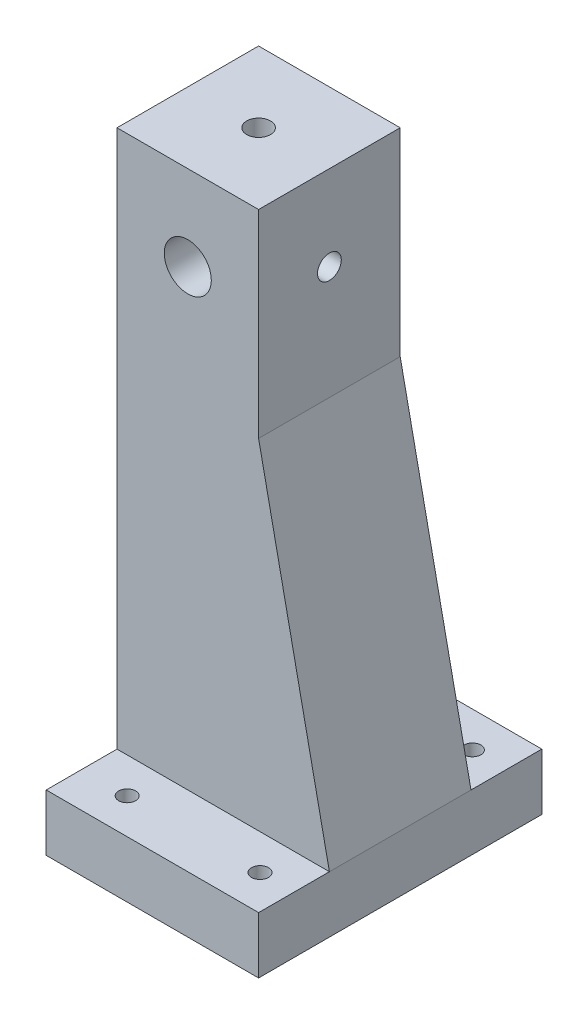
ISO-10303-21;
HEADER;
FILE_DESCRIPTION(('STEP AP214'),'2;1');
FILE_NAME('part.step','',(''),(''),'','','');
FILE_SCHEMA(('AUTOMOTIVE_DESIGN { 1 0 10303 214 1 1 1 1 }'));
ENDSEC;
DATA;
#1=APPLICATION_CONTEXT('core data for automotive mechanical design processes');
#2=APPLICATION_PROTOCOL_DEFINITION('international standard','automotive_design',2000,#1);
#3=PRODUCT_CONTEXT('',#1,'mechanical');
#4=PRODUCT('Part','Part','',(#3));
#5=PRODUCT_RELATED_PRODUCT_CATEGORY('part','',(#4));
#6=PRODUCT_DEFINITION_FORMATION('','',#4);
#7=PRODUCT_DEFINITION_CONTEXT('part definition',#1,'design');
#8=PRODUCT_DEFINITION('design','',#6,#7);
#9=PRODUCT_DEFINITION_SHAPE('','',#8);
#10=(LENGTH_UNIT() NAMED_UNIT(*) SI_UNIT(.MILLI.,.METRE.));
#11=(NAMED_UNIT(*) PLANE_ANGLE_UNIT() SI_UNIT($,.RADIAN.));
#12=(NAMED_UNIT(*) SI_UNIT($,.STERADIAN.) SOLID_ANGLE_UNIT());
#13=UNCERTAINTY_MEASURE_WITH_UNIT(LENGTH_MEASURE(1.E-05),#10,'distance_accuracy_value','');
#14=(GEOMETRIC_REPRESENTATION_CONTEXT(3) GLOBAL_UNCERTAINTY_ASSIGNED_CONTEXT((#13)) GLOBAL_UNIT_ASSIGNED_CONTEXT((#10,
#11,#12)) REPRESENTATION_CONTEXT('',''));
#15=CARTESIAN_POINT('',(0.,0.,0.));
#16=DIRECTION('',(0.,0.,1.));
#17=DIRECTION('',(1.,0.,0.));
#18=AXIS2_PLACEMENT_3D('',#15,#16,#17);
#19=CARTESIAN_POINT('',(0.,9.99999999999999,0.));
#20=DIRECTION('',(0.,1.,0.));
#21=DIRECTION('',(0.,0.,1.));
#22=AXIS2_PLACEMENT_3D('',#19,#20,#21);
#23=PLANE('',#22);
#24=CARTESIAN_POINT('',(-4.45648688352142,10.,-18.75));
#25=DIRECTION('',(0.,1.,0.));
#26=DIRECTION('',(0.,0.,1.));
#27=AXIS2_PLACEMENT_3D('',#24,#25,#26);
#28=CIRCLE('',#27,1.5);
#29=CARTESIAN_POINT('',(-4.45648688352142,10.,-17.25));
#30=VERTEX_POINT('',#29);
#31=EDGE_CURVE('E277',#30,#30,#28,.T.);
#32=ORIENTED_EDGE('',*,*,#31,.F.);
#33=EDGE_LOOP('',(#32));
#34=FACE_BOUND('',#33,.T.);
#35=CARTESIAN_POINT('',(19.,9.99999999999999,-18.75));
#36=DIRECTION('',(0.,1.,0.));
#37=DIRECTION('',(0.,0.,1.));
#38=AXIS2_PLACEMENT_3D('',#35,#36,#37);
#39=CIRCLE('',#38,1.5);
#40=CARTESIAN_POINT('',(19.,9.99999999999999,-17.25));
#41=VERTEX_POINT('',#40);
#42=EDGE_CURVE('E139',#41,#41,#39,.T.);
#43=ORIENTED_EDGE('',*,*,#42,.F.);
#44=EDGE_LOOP('',(#43));
#45=FACE_BOUND('',#44,.T.);
#46=DIRECTION('',(1.,0.,0.));
#47=VECTOR('',#46,1.);
#48=CARTESIAN_POINT('',(0.,10.,-12.5));
#49=LINE('',#48,#47);
#50=CARTESIAN_POINT('',(-12.5,10.,-12.5));
#51=VERTEX_POINT('',#50);
#52=CARTESIAN_POINT('',(25.,9.99999999999999,-12.5));
#53=VERTEX_POINT('',#52);
#54=EDGE_CURVE('E48',#51,#53,#49,.T.);
#55=ORIENTED_EDGE('',*,*,#54,.T.);
#56=DIRECTION('',(0.,0.,-1.));
#57=VECTOR('',#56,1.);
#58=CARTESIAN_POINT('',(25.,9.99999999999997,0.));
#59=LINE('',#58,#57);
#60=CARTESIAN_POINT('',(25.,9.99999999999999,-25.0000000000001));
#61=VERTEX_POINT('',#60);
#62=EDGE_CURVE('E138',#53,#61,#59,.T.);
#63=ORIENTED_EDGE('',*,*,#62,.T.);
#64=DIRECTION('',(-1.,0.,0.));
#65=VECTOR('',#64,1.);
#66=CARTESIAN_POINT('',(0.,10.,-25.));
#67=LINE('',#66,#65);
#68=CARTESIAN_POINT('',(-12.5,10.,-25.));
#69=VERTEX_POINT('',#68);
#70=EDGE_CURVE('E291',#61,#69,#67,.T.);
#71=ORIENTED_EDGE('',*,*,#70,.T.);
#72=DIRECTION('',(0.,0.,-1.));
#73=VECTOR('',#72,1.);
#74=CARTESIAN_POINT('',(-12.5,10.,-25.));
#75=LINE('',#74,#73);
#76=EDGE_CURVE('E263',#51,#69,#75,.T.);
#77=ORIENTED_EDGE('',*,*,#76,.F.);
#78=EDGE_LOOP('',(#55,#63,#71,#77));
#79=FACE_BOUND('',#78,.T.);
#80=ADVANCED_FACE('F34',(#34,#45,#79),#23,.T.);
#81=CARTESIAN_POINT('',(12.5,105.,0.));
#82=DIRECTION('',(1.,0.,0.));
#83=DIRECTION('',(0.,0.,-1.));
#84=AXIS2_PLACEMENT_3D('',#81,#82,#83);
#85=PLANE('',#84);
#86=CARTESIAN_POINT('',(12.5,90.,0.));
#87=DIRECTION('',(1.,0.,0.));
#88=DIRECTION('',(0.,0.,-1.));
#89=AXIS2_PLACEMENT_3D('',#86,#87,#88);
#90=CIRCLE('',#89,2.10000000000001);
#91=CARTESIAN_POINT('',(12.5,90.,-2.10000000000009));
#92=VERTEX_POINT('',#91);
#93=EDGE_CURVE('E164',#92,#92,#90,.T.);
#94=ORIENTED_EDGE('',*,*,#93,.F.);
#95=EDGE_LOOP('',(#94));
#96=FACE_BOUND('',#95,.T.);
#97=DIRECTION('',(0.,-1.,0.));
#98=VECTOR('',#97,1.);
#99=CARTESIAN_POINT('',(12.5,105.,12.4999999999999));
#100=LINE('',#99,#98);
#101=CARTESIAN_POINT('',(12.5,105.,12.4999999999999));
#102=VERTEX_POINT('',#101);
#103=CARTESIAN_POINT('',(12.5,70.,12.4999999999999));
#104=VERTEX_POINT('',#103);
#105=EDGE_CURVE('E254',#102,#104,#100,.T.);
#106=ORIENTED_EDGE('',*,*,#105,.T.);
#107=DIRECTION('',(0.,0.,-1.));
#108=VECTOR('',#107,1.);
#109=CARTESIAN_POINT('',(12.5,70.,12.4999999999999));
#110=LINE('',#109,#108);
#111=CARTESIAN_POINT('',(12.5,70.,-12.5000000000001));
#112=VERTEX_POINT('',#111);
#113=EDGE_CURVE('E127',#104,#112,#110,.T.);
#114=ORIENTED_EDGE('',*,*,#113,.T.);
#115=DIRECTION('',(0.,-1.,0.));
#116=VECTOR('',#115,1.);
#117=CARTESIAN_POINT('',(12.5,105.,-12.5000000000001));
#118=LINE('',#117,#116);
#119=CARTESIAN_POINT('',(12.5,105.,-12.5000000000001));
#120=VERTEX_POINT('',#119);
#121=EDGE_CURVE('E151',#120,#112,#118,.T.);
#122=ORIENTED_EDGE('',*,*,#121,.F.);
#123=DIRECTION('',(0.,0.,1.));
#124=VECTOR('',#123,1.);
#125=CARTESIAN_POINT('',(12.5,105.,0.));
#126=LINE('',#125,#124);
#127=EDGE_CURVE('E156',#120,#102,#126,.T.);
#128=ORIENTED_EDGE('',*,*,#127,.T.);
#129=EDGE_LOOP('',(#106,#114,#122,#128));
#130=FACE_BOUND('',#129,.T.);
#131=ADVANCED_FACE('F205',(#96,#130),#85,.T.);
#132=CARTESIAN_POINT('',(0.,10.,12.4999999999999));
#133=DIRECTION('',(0.,0.,-1.));
#134=DIRECTION('',(-1.,0.,0.));
#135=AXIS2_PLACEMENT_3D('',#132,#133,#134);
#136=PLANE('',#135);
#137=CARTESIAN_POINT('',(0.,90.,12.4999999999999));
#138=DIRECTION('',(0.,0.,1.));
#139=DIRECTION('',(1.,0.,0.));
#140=AXIS2_PLACEMENT_3D('',#137,#138,#139);
#141=CIRCLE('',#140,4.15);
#142=CARTESIAN_POINT('',(4.14999999999997,90.,12.4999999999999));
#143=VERTEX_POINT('',#142);
#144=EDGE_CURVE('E157',#143,#143,#141,.T.);
#145=ORIENTED_EDGE('',*,*,#144,.F.);
#146=EDGE_LOOP('',(#145));
#147=FACE_BOUND('',#146,.T.);
#148=DIRECTION('',(0.,-1.,0.));
#149=VECTOR('',#148,1.);
#150=CARTESIAN_POINT('',(-12.5000000000001,105.,12.5));
#151=LINE('',#150,#149);
#152=CARTESIAN_POINT('',(-12.5000000000001,105.,12.5));
#153=VERTEX_POINT('',#152);
#154=CARTESIAN_POINT('',(-12.5,10.,12.4999999999999));
#155=VERTEX_POINT('',#154);
#156=EDGE_CURVE('E116',#153,#155,#151,.T.);
#157=ORIENTED_EDGE('',*,*,#156,.T.);
#158=DIRECTION('',(1.,0.,0.));
#159=VECTOR('',#158,1.);
#160=CARTESIAN_POINT('',(0.,10.,12.4999999999999));
#161=LINE('',#160,#159);
#162=CARTESIAN_POINT('',(25.,9.99999999999998,12.5));
#163=VERTEX_POINT('',#162);
#164=EDGE_CURVE('E11',#155,#163,#161,.T.);
#165=ORIENTED_EDGE('',*,*,#164,.T.);
#166=DIRECTION('',(-0.203954254112001,0.978980419737605,0.));
#167=VECTOR('',#166,1.);
#168=CARTESIAN_POINT('',(25.,9.99999999999998,12.5));
#169=LINE('',#168,#167);
#170=EDGE_CURVE('E113',#163,#104,#169,.T.);
#171=ORIENTED_EDGE('',*,*,#170,.T.);
#172=ORIENTED_EDGE('',*,*,#105,.F.);
#173=DIRECTION('',(1.,0.,0.));
#174=VECTOR('',#173,1.);
#175=CARTESIAN_POINT('',(0.,105.,12.5));
#176=LINE('',#175,#174);
#177=EDGE_CURVE('E64',#153,#102,#176,.T.);
#178=ORIENTED_EDGE('',*,*,#177,.F.);
#179=EDGE_LOOP('',(#157,#165,#171,#172,#178));
#180=FACE_BOUND('',#179,.T.);
#181=ADVANCED_FACE('F36',(#147,#180),#136,.F.);
#182=CARTESIAN_POINT('',(25.,9.99999999999997,0.));
#183=DIRECTION('',(-1.,0.,0.));
#184=DIRECTION('',(0.,0.,1.));
#185=AXIS2_PLACEMENT_3D('',#182,#183,#184);
#186=PLANE('',#185);
#187=DIRECTION('',(0.,0.,-1.));
#188=VECTOR('',#187,1.);
#189=CARTESIAN_POINT('',(25.,0.,0.));
#190=LINE('',#189,#188);
#191=CARTESIAN_POINT('',(25.,0.,25.));
#192=VERTEX_POINT('',#191);
#193=CARTESIAN_POINT('',(25.,0.,-25.0000000000001));
#194=VERTEX_POINT('',#193);
#195=EDGE_CURVE('E148',#192,#194,#190,.T.);
#196=ORIENTED_EDGE('',*,*,#195,.T.);
#197=DIRECTION('',(0.,-1.,0.));
#198=VECTOR('',#197,1.);
#199=CARTESIAN_POINT('',(25.,9.99999999999999,-25.0000000000001));
#200=LINE('',#199,#198);
#201=EDGE_CURVE('E293',#61,#194,#200,.T.);
#202=ORIENTED_EDGE('',*,*,#201,.F.);
#203=ORIENTED_EDGE('',*,*,#62,.F.);
#204=DIRECTION('',(0.,0.,-1.));
#205=VECTOR('',#204,1.);
#206=CARTESIAN_POINT('',(25.,9.99999999999998,12.5));
#207=LINE('',#206,#205);
#208=EDGE_CURVE('E124',#163,#53,#207,.T.);
#209=ORIENTED_EDGE('',*,*,#208,.F.);
#210=CARTESIAN_POINT('',(25.,9.99999999999998,24.9999999999999));
#211=VERTEX_POINT('',#210);
#212=EDGE_CURVE('E135',#211,#163,#59,.T.);
#213=ORIENTED_EDGE('',*,*,#212,.F.);
#214=DIRECTION('',(0.,-1.,0.));
#215=VECTOR('',#214,1.);
#216=CARTESIAN_POINT('',(25.,9.99999999999998,24.9999999999999));
#217=LINE('',#216,#215);
#218=EDGE_CURVE('E285',#211,#192,#217,.T.);
#219=ORIENTED_EDGE('',*,*,#218,.T.);
#220=EDGE_LOOP('',(#196,#202,#203,#209,#213,#219));
#221=FACE_BOUND('',#220,.T.);
#222=ADVANCED_FACE('F133',(#221),#186,.F.);
#223=CARTESIAN_POINT('',(0.,10.,-12.5));
#224=DIRECTION('',(0.,0.,-1.));
#225=DIRECTION('',(-1.,0.,0.));
#226=AXIS2_PLACEMENT_3D('',#223,#224,#225);
#227=PLANE('',#226);
#228=ORIENTED_EDGE('',*,*,#54,.F.);
#229=DIRECTION('',(0.,-1.,0.));
#230=VECTOR('',#229,1.);
#231=CARTESIAN_POINT('',(-12.5,105.,-12.5000000000001));
#232=LINE('',#231,#230);
#233=CARTESIAN_POINT('',(-12.5,105.,-12.5000000000001));
#234=VERTEX_POINT('',#233);
#235=EDGE_CURVE('E256',#234,#51,#232,.T.);
#236=ORIENTED_EDGE('',*,*,#235,.F.);
#237=DIRECTION('',(1.,0.,0.));
#238=VECTOR('',#237,1.);
#239=CARTESIAN_POINT('',(0.,105.,-12.5000000000001));
#240=LINE('',#239,#238);
#241=EDGE_CURVE('E248',#234,#120,#240,.T.);
#242=ORIENTED_EDGE('',*,*,#241,.T.);
#243=ORIENTED_EDGE('',*,*,#121,.T.);
#244=DIRECTION('',(-0.203954254112001,0.978980419737605,0.));
#245=VECTOR('',#244,1.);
#246=CARTESIAN_POINT('',(25.,9.99999999999999,-12.5));
#247=LINE('',#246,#245);
#248=EDGE_CURVE('E129',#53,#112,#247,.T.);
#249=ORIENTED_EDGE('',*,*,#248,.F.);
#250=EDGE_LOOP('',(#228,#236,#242,#243,#249));
#251=FACE_BOUND('',#250,.T.);
#252=CARTESIAN_POINT('',(0.,90.,-12.5000000000001));
#253=DIRECTION('',(0.,0.,-1.));
#254=DIRECTION('',(-1.,0.,0.));
#255=AXIS2_PLACEMENT_3D('',#252,#253,#254);
#256=CIRCLE('',#255,4.15);
#257=CARTESIAN_POINT('',(-4.15000000000001,90.,-12.5000000000001));
#258=VERTEX_POINT('',#257);
#259=EDGE_CURVE('E154',#258,#258,#256,.T.);
#260=ORIENTED_EDGE('',*,*,#259,.F.);
#261=EDGE_LOOP('',(#260));
#262=FACE_BOUND('',#261,.T.);
#263=ADVANCED_FACE('F218',(#251,#262),#227,.T.);
#264=ORIENTED_EDGE('',*,*,#212,.T.);
#265=ORIENTED_EDGE('',*,*,#164,.F.);
#266=CARTESIAN_POINT('',(-12.5,9.99999999999999,25.));
#267=VERTEX_POINT('',#266);
#268=EDGE_CURVE('E261',#267,#155,#75,.T.);
#269=ORIENTED_EDGE('',*,*,#268,.F.);
#270=DIRECTION('',(-1.,0.,0.));
#271=VECTOR('',#270,1.);
#272=CARTESIAN_POINT('',(0.,10.,25.));
#273=LINE('',#272,#271);
#274=EDGE_CURVE('E145',#211,#267,#273,.T.);
#275=ORIENTED_EDGE('',*,*,#274,.F.);
#276=EDGE_LOOP('',(#264,#265,#269,#275));
#277=FACE_BOUND('',#276,.T.);
#278=CARTESIAN_POINT('',(19.,9.99999999999998,18.7499999999999));
#279=DIRECTION('',(0.,1.,0.));
#280=DIRECTION('',(0.,0.,1.));
#281=AXIS2_PLACEMENT_3D('',#278,#279,#280);
#282=CIRCLE('',#281,1.5);
#283=CARTESIAN_POINT('',(19.,9.99999999999998,20.2499999999999));
#284=VERTEX_POINT('',#283);
#285=EDGE_CURVE('E324',#284,#284,#282,.T.);
#286=ORIENTED_EDGE('',*,*,#285,.F.);
#287=EDGE_LOOP('',(#286));
#288=FACE_BOUND('',#287,.T.);
#289=CARTESIAN_POINT('',(-4.4564868835214,10.,18.7499999999999));
#290=DIRECTION('',(0.,1.,0.));
#291=DIRECTION('',(0.,0.,1.));
#292=AXIS2_PLACEMENT_3D('',#289,#290,#291);
#293=CIRCLE('',#292,1.5);
#294=CARTESIAN_POINT('',(-4.4564868835214,10.,20.2499999999999));
#295=VERTEX_POINT('',#294);
#296=EDGE_CURVE('E271',#295,#295,#293,.T.);
#297=ORIENTED_EDGE('',*,*,#296,.F.);
#298=EDGE_LOOP('',(#297));
#299=FACE_BOUND('',#298,.T.);
#300=ADVANCED_FACE('F142',(#277,#288,#299),#23,.T.);
#301=CARTESIAN_POINT('',(0.,0.,0.));
#302=DIRECTION('',(0.,1.,0.));
#303=DIRECTION('',(0.,0.,1.));
#304=AXIS2_PLACEMENT_3D('',#301,#302,#303);
#305=PLANE('',#304);
#306=CARTESIAN_POINT('',(19.,0.,18.7499999999999));
#307=DIRECTION('',(0.,1.,0.));
#308=DIRECTION('',(0.,0.,1.));
#309=AXIS2_PLACEMENT_3D('',#306,#307,#308);
#310=CIRCLE('',#309,1.5);
#311=CARTESIAN_POINT('',(19.,0.,20.2499999999999));
#312=VERTEX_POINT('',#311);
#313=EDGE_CURVE('E318',#312,#312,#310,.T.);
#314=ORIENTED_EDGE('',*,*,#313,.T.);
#315=EDGE_LOOP('',(#314));
#316=FACE_BOUND('',#315,.T.);
#317=CARTESIAN_POINT('',(19.,0.,-18.75));
#318=DIRECTION('',(0.,1.,0.));
#319=DIRECTION('',(0.,0.,1.));
#320=AXIS2_PLACEMENT_3D('',#317,#318,#319);
#321=CIRCLE('',#320,1.5);
#322=CARTESIAN_POINT('',(19.,0.,-17.25));
#323=VERTEX_POINT('',#322);
#324=EDGE_CURVE('E321',#323,#323,#321,.T.);
#325=ORIENTED_EDGE('',*,*,#324,.T.);
#326=EDGE_LOOP('',(#325));
#327=FACE_BOUND('',#326,.T.);
#328=CARTESIAN_POINT('',(-4.45648688352142,0.,-18.75));
#329=DIRECTION('',(0.,1.,0.));
#330=DIRECTION('',(0.,0.,1.));
#331=AXIS2_PLACEMENT_3D('',#328,#329,#330);
#332=CIRCLE('',#331,1.5);
#333=CARTESIAN_POINT('',(-4.45648688352142,0.,-17.25));
#334=VERTEX_POINT('',#333);
#335=EDGE_CURVE('E273',#334,#334,#332,.T.);
#336=ORIENTED_EDGE('',*,*,#335,.T.);
#337=EDGE_LOOP('',(#336));
#338=FACE_BOUND('',#337,.T.);
#339=CARTESIAN_POINT('',(-4.4564868835214,0.,18.75));
#340=DIRECTION('',(0.,1.,0.));
#341=DIRECTION('',(0.,0.,1.));
#342=AXIS2_PLACEMENT_3D('',#339,#340,#341);
#343=CIRCLE('',#342,1.5);
#344=CARTESIAN_POINT('',(-4.4564868835214,0.,20.25));
#345=VERTEX_POINT('',#344);
#346=EDGE_CURVE('E280',#345,#345,#343,.T.);
#347=ORIENTED_EDGE('',*,*,#346,.T.);
#348=EDGE_LOOP('',(#347));
#349=FACE_BOUND('',#348,.T.);
#350=DIRECTION('',(-1.,0.,0.));
#351=VECTOR('',#350,1.);
#352=CARTESIAN_POINT('',(0.,0.,25.));
#353=LINE('',#352,#351);
#354=CARTESIAN_POINT('',(-12.5,0.,25.));
#355=VERTEX_POINT('',#354);
#356=EDGE_CURVE('E276',#192,#355,#353,.T.);
#357=ORIENTED_EDGE('',*,*,#356,.T.);
#358=DIRECTION('',(0.,0.,-1.));
#359=VECTOR('',#358,1.);
#360=CARTESIAN_POINT('',(-12.5,0.,12.5));
#361=LINE('',#360,#359);
#362=CARTESIAN_POINT('',(-12.5,0.,-25.));
#363=VERTEX_POINT('',#362);
#364=EDGE_CURVE('E56',#355,#363,#361,.T.);
#365=ORIENTED_EDGE('',*,*,#364,.T.);
#366=DIRECTION('',(-1.,0.,0.));
#367=VECTOR('',#366,1.);
#368=CARTESIAN_POINT('',(0.,0.,-25.));
#369=LINE('',#368,#367);
#370=EDGE_CURVE('E290',#194,#363,#369,.T.);
#371=ORIENTED_EDGE('',*,*,#370,.F.);
#372=ORIENTED_EDGE('',*,*,#195,.F.);
#373=EDGE_LOOP('',(#357,#365,#371,#372));
#374=FACE_BOUND('',#373,.T.);
#375=ADVANCED_FACE('F217',(#316,#327,#338,#349,#374),#305,.F.);
#376=CARTESIAN_POINT('',(-12.5,105.,0.));
#377=DIRECTION('',(1.,0.,0.));
#378=DIRECTION('',(0.,0.,-1.));
#379=AXIS2_PLACEMENT_3D('',#376,#377,#378);
#380=PLANE('',#379);
#381=ORIENTED_EDGE('',*,*,#235,.T.);
#382=ORIENTED_EDGE('',*,*,#76,.T.);
#383=DIRECTION('',(0.,1.,0.));
#384=VECTOR('',#383,1.);
#385=CARTESIAN_POINT('',(-12.5,0.,-25.));
#386=LINE('',#385,#384);
#387=EDGE_CURVE('E268',#363,#69,#386,.T.);
#388=ORIENTED_EDGE('',*,*,#387,.F.);
#389=ORIENTED_EDGE('',*,*,#364,.F.);
#390=DIRECTION('',(0.,1.,0.));
#391=VECTOR('',#390,1.);
#392=CARTESIAN_POINT('',(-12.5,0.,25.));
#393=LINE('',#392,#391);
#394=EDGE_CURVE('E262',#355,#267,#393,.T.);
#395=ORIENTED_EDGE('',*,*,#394,.T.);
#396=ORIENTED_EDGE('',*,*,#268,.T.);
#397=ORIENTED_EDGE('',*,*,#156,.F.);
#398=DIRECTION('',(0.,0.,1.));
#399=VECTOR('',#398,1.);
#400=CARTESIAN_POINT('',(-12.5,105.,0.));
#401=LINE('',#400,#399);
#402=EDGE_CURVE('E251',#234,#153,#401,.T.);
#403=ORIENTED_EDGE('',*,*,#402,.F.);
#404=EDGE_LOOP('',(#381,#382,#388,#389,#395,#396,#397,#403));
#405=FACE_BOUND('',#404,.T.);
#406=ADVANCED_FACE('F223',(#405),#380,.F.);
#407=CARTESIAN_POINT('',(0.,105.,0.));
#408=DIRECTION('',(0.,1.,0.));
#409=DIRECTION('',(0.,0.,1.));
#410=AXIS2_PLACEMENT_3D('',#407,#408,#409);
#411=PLANE('',#410);
#412=CARTESIAN_POINT('',(0.,105.,0.));
#413=DIRECTION('',(0.,1.,0.));
#414=DIRECTION('',(0.,0.,1.));
#415=AXIS2_PLACEMENT_3D('',#412,#413,#414);
#416=CIRCLE('',#415,2.1);
#417=CARTESIAN_POINT('',(0.,105.,2.09999999999994));
#418=VERTEX_POINT('',#417);
#419=EDGE_CURVE('E315',#418,#418,#416,.T.);
#420=ORIENTED_EDGE('',*,*,#419,.F.);
#421=EDGE_LOOP('',(#420));
#422=FACE_BOUND('',#421,.T.);
#423=ORIENTED_EDGE('',*,*,#127,.F.);
#424=ORIENTED_EDGE('',*,*,#241,.F.);
#425=ORIENTED_EDGE('',*,*,#402,.T.);
#426=ORIENTED_EDGE('',*,*,#177,.T.);
#427=EDGE_LOOP('',(#423,#424,#425,#426));
#428=FACE_BOUND('',#427,.T.);
#429=ADVANCED_FACE('F237',(#422,#428),#411,.T.);
#430=CARTESIAN_POINT('',(0.,90.,-47.5000000000001));
#431=DIRECTION('',(0.,0.,1.));
#432=DIRECTION('',(1.,0.,0.));
#433=AXIS2_PLACEMENT_3D('',#430,#431,#432);
#434=CYLINDRICAL_SURFACE('',#433,4.15);
#435=CARTESIAN_POINT('',(0.,94.15,2.09999999999994));
#436=CARTESIAN_POINT('',(0.110238161173121,94.1499929475028,2.0999917443694));
#437=CARTESIAN_POINT('',(0.22060776370452,94.1455602234877,2.09126796748186));
#438=CARTESIAN_POINT('',(0.438072312580785,94.1282623964397,2.05676056482253));
#439=CARTESIAN_POINT('',(0.545160860900864,94.1153817951459,2.03094558313603));
#440=CARTESIAN_POINT('',(0.752590906304786,94.0825350441297,1.96353067021776));
#441=CARTESIAN_POINT('',(0.852957042631672,94.0625966687342,1.92199257007712));
#442=CARTESIAN_POINT('',(1.04514103844506,94.0174543009987,1.82463573721925));
#443=CARTESIAN_POINT('',(1.13695943808057,93.9922506417097,1.76881790770403));
#444=CARTESIAN_POINT('',(1.31579602505949,93.9370634434205,1.64058583874114));
#445=CARTESIAN_POINT('',(1.40217130660822,93.9068812253157,1.56736178767371));
#446=CARTESIAN_POINT('',(1.56200990721388,93.8457718531221,1.40814316972257));
#447=CARTESIAN_POINT('',(1.6354631299851,93.8148441378223,1.32213871315668));
#448=CARTESIAN_POINT('',(1.77326451657109,93.7528906447462,1.13156391637495));
#449=CARTESIAN_POINT('',(1.83641582709837,93.7220545752557,1.02605911523579));
#450=CARTESIAN_POINT('',(1.94381193200397,93.6671184545558,0.80420811361668));
#451=CARTESIAN_POINT('',(1.98807046424642,93.6430135132396,0.68786986590971));
#452=CARTESIAN_POINT('',(2.05350619124435,93.6065148221683,0.454809664859468));
#453=CARTESIAN_POINT('',(2.07591712390729,93.593501115646,0.33853619360874));
#454=CARTESIAN_POINT('',(2.10078710795461,93.5790257548496,0.103212407595587));
#455=CARTESIAN_POINT('',(2.103266755835,93.5775521753346,-0.0158349130798773));
#456=CARTESIAN_POINT('',(2.08910778296225,93.5858272874689,-0.237544179811708));
#457=CARTESIAN_POINT('',(2.07478733976483,93.5942155014001,-0.340417564834577));
#458=CARTESIAN_POINT('',(2.03146086945254,93.6188785411737,-0.542036766540068));
#459=CARTESIAN_POINT('',(2.00244996982589,93.6351559836285,-0.640781201966484));
#460=CARTESIAN_POINT('',(1.93004934851671,93.6741154829411,-0.834161230492022));
#461=CARTESIAN_POINT('',(1.88634125882564,93.6969375365386,-0.92864808729685));
#462=CARTESIAN_POINT('',(1.78603384056708,93.7464260261886,-1.10940518457595));
#463=CARTESIAN_POINT('',(1.72942871640221,93.7730941886005,-1.19567170624902));
#464=CARTESIAN_POINT('',(1.59633858021704,93.8314668391252,-1.36937220440558));
#465=CARTESIAN_POINT('',(1.51822431916806,93.8633748059574,-1.4554938816445));
#466=CARTESIAN_POINT('',(1.34854995768408,93.9258231794052,-1.61396946734066));
#467=CARTESIAN_POINT('',(1.25698317065101,93.9563628960216,-1.68631648778663));
#468=CARTESIAN_POINT('',(1.05737448728485,94.0144445515142,-1.81850585921281));
#469=CARTESIAN_POINT('',(0.948747952957706,94.0417684876743,-1.87756902249401));
#470=CARTESIAN_POINT('',(0.721369186730676,94.088465753079,-1.97609271539929));
#471=CARTESIAN_POINT('',(0.602625269007625,94.1078455359234,-2.01556916221156));
#472=CARTESIAN_POINT('',(0.36909301637403,94.1350828770617,-2.07048932503787));
#473=CARTESIAN_POINT('',(0.25481261774883,94.143772770413,-2.08767579577977));
#474=CARTESIAN_POINT('',(0.0246770196962225,94.1515202061055,-2.10301454823759));
#475=CARTESIAN_POINT('',(-0.0911773784048178,94.1505824789641,-2.10117617777812));
#476=CARTESIAN_POINT('',(-0.311333495808021,94.139656614143,-2.07950159531354));
#477=CARTESIAN_POINT('',(-0.41581930257643,94.1303967381464,-2.06111345195844));
#478=CARTESIAN_POINT('',(-0.620004362533597,94.1047152426679,-2.00915304247643));
#479=CARTESIAN_POINT('',(-0.719703092355314,94.0882928420834,-1.97557912026349));
#480=CARTESIAN_POINT('',(-0.914733047315186,94.049189973133,-1.89335192542993));
#481=CARTESIAN_POINT('',(-1.00986327728521,94.0263468638718,-1.8443020355142));
#482=CARTESIAN_POINT('',(-1.1908512401654,93.976581076871,-1.73296726141596));
#483=CARTESIAN_POINT('',(-1.27670504544634,93.9496566826224,-1.67067680405346));
#484=CARTESIAN_POINT('',(-1.44581203119879,93.8911323657193,-1.52744952956757));
#485=CARTESIAN_POINT('',(-1.52794674238206,93.8593341294591,-1.44527102212432));
#486=CARTESIAN_POINT('',(-1.67777792809814,93.7966001300007,-1.26827450961205));
#487=CARTESIAN_POINT('',(-1.74546381421525,93.7656650136487,-1.1734473174322));
#488=CARTESIAN_POINT('',(-1.86778579798251,93.706579607241,-0.967688487664513));
#489=CARTESIAN_POINT('',(-1.92156752065927,93.6786556159844,-0.85617809540746));
#490=CARTESIAN_POINT('',(-2.00902739179166,93.6316401054321,-0.623829928195731));
#491=CARTESIAN_POINT('',(-2.04273203427686,93.6125369535413,-0.50300468427561));
#492=CARTESIAN_POINT('',(-2.08592383162368,93.5877551077485,-0.267935011524334));
#493=CARTESIAN_POINT('',(-2.09743731648651,93.5809570831019,-0.154183725990508));
#494=CARTESIAN_POINT('',(-2.10179296154571,93.5784049738959,0.0737779578066166));
#495=CARTESIAN_POINT('',(-2.09464389509156,93.5826456999675,0.187988115148044));
#496=CARTESIAN_POINT('',(-2.06378278284569,93.6004940944176,0.401596873045034));
#497=CARTESIAN_POINT('',(-2.04179364491585,93.6131254322425,0.501336697886633));
#498=CARTESIAN_POINT('',(-1.98404388983515,93.6451548144948,0.695589426678477));
#499=CARTESIAN_POINT('',(-1.94827875292786,93.6645550795373,0.790100603515146));
#500=CARTESIAN_POINT('',(-1.86131973951898,93.709518959358,0.978233394116812));
#501=CARTESIAN_POINT('',(-1.80925273716977,93.735408414024,1.07137121020383));
#502=CARTESIAN_POINT('',(-1.69211642830723,93.7899097830613,1.24820072887558));
#503=CARTESIAN_POINT('',(-1.62704027608691,93.8185231266341,1.33188742162862));
#504=CARTESIAN_POINT('',(-1.47615074098071,93.8795476769145,1.49837390774208));
#505=CARTESIAN_POINT('',(-1.38875957765378,93.9119846760308,1.57974319581304));
#506=CARTESIAN_POINT('',(-1.20072798760135,93.9737336926957,1.72700054470831));
#507=CARTESIAN_POINT('',(-1.10008025259929,94.003043970249,1.79288000987121));
#508=CARTESIAN_POINT('',(-0.886537963772834,94.0556996040937,1.90757246091809));
#509=CARTESIAN_POINT('',(-0.7735330434261,94.0789836803461,1.95621184339311));
#510=CARTESIAN_POINT('',(-0.598214812475338,94.107087429043,2.01393547842918));
#511=CARTESIAN_POINT('',(-0.538849744979325,94.1153149656947,2.03063119303681));
#512=CARTESIAN_POINT('',(-0.418614027723458,94.129274965824,2.05877746036198));
#513=CARTESIAN_POINT('',(-0.357744306239541,94.1350089289863,2.07023116594584));
#514=CARTESIAN_POINT('',(-0.247408070396001,94.1429100680698,2.08596248439328));
#515=CARTESIAN_POINT('',(-0.198113429714892,94.1455629647148,2.09122067680181));
#516=CARTESIAN_POINT('',(-0.0992214098179501,94.1491095420017,2.0982413403853));
#517=CARTESIAN_POINT('',(-0.0496240223888898,94.1500031747017,2.10000371629554));
#518=CARTESIAN_POINT('',(0.,94.15,2.09999999999994));
#519=B_SPLINE_CURVE_WITH_KNOTS('',3,(#435,#436,#437,#438,#439,#440,#441,#442,#443,#444,#445,
#446,#447,#448,#449,#450,#451,#452,#453,#454,#455,#456,#457,#458,#459,#460,#461,#462,#463,#464,
#465,#466,#467,#468,#469,#470,#471,#472,#473,#474,#475,#476,#477,#478,#479,#480,#481,#482,#483,
#484,#485,#486,#487,#488,#489,#490,#491,#492,#493,#494,#495,#496,#497,#498,#499,#500,#501,#502,
#503,#504,#505,#506,#507,#508,#509,#510,#511,#512,#513,#514,#515,#516,#517,#518),.UNSPECIFIED.,
.T.,.F.,(4,2,2,2,2,2,2,2,2,2,2,2,2,2,2,2,2,2,2,2,2,2,2,2,2,2,2,2,2,2,2,2,2,2,2,2,2,2,2,2,2,4),
(0.,0.330521695521807,0.661651460275993,0.991492363778132,1.32131240978846,1.67142484294783,
2.0218096232539,2.40019742549865,2.77830961280843,3.13356063833206,3.48844450898769,
3.79959818150548,4.1108551247397,4.42934264339301,4.74797356545747,5.10811877527323,
5.4684436052685,5.84629091789192,6.22383066707548,6.569601707049,6.91520286105722,
7.23322250966043,7.55127684828055,7.87825399851062,8.20536905248933,8.56519344036309,
8.92528061703107,9.30396245559868,9.68214346623988,10.023761480697,10.3652189279099,
10.672623264352,10.9801285428616,11.3082352293337,11.6365150295759,12.006010632461,
12.3757107956226,12.7490345207904,12.9354401770303,13.1217335696357,13.270514798345,
13.4193000814451),.UNSPECIFIED.);
#520=CARTESIAN_POINT('',(0.,94.15,2.09999999999994));
#521=VERTEX_POINT('',#520);
#522=EDGE_CURVE('E38',#521,#521,#519,.T.);
#523=ORIENTED_EDGE('',*,*,#522,.T.);
#524=EDGE_LOOP('',(#523));
#525=FACE_BOUND('',#524,.T.);
#526=CARTESIAN_POINT('',(4.14999999999997,90.,-2.10000000000007));
#527=CARTESIAN_POINT('',(4.14999294750281,90.1102381611731,-2.09999174436952));
#528=CARTESIAN_POINT('',(4.14556022348771,90.2206077637045,-2.09126796748202));
#529=CARTESIAN_POINT('',(4.12826239643966,90.4380723125808,-2.05676056482272));
#530=CARTESIAN_POINT('',(4.11538179514591,90.5451608609009,-2.0309455831362));
#531=CARTESIAN_POINT('',(4.08253504412973,90.7525909063048,-1.96353067021793));
#532=CARTESIAN_POINT('',(4.06259666873419,90.8529570426317,-1.9219925700773));
#533=CARTESIAN_POINT('',(4.01745430099868,91.0451410384451,-1.82463573721944));
#534=CARTESIAN_POINT('',(3.99225064170975,91.1369594380806,-1.76881790770422));
#535=CARTESIAN_POINT('',(3.93706344342054,91.3157960250595,-1.64058583874134));
#536=CARTESIAN_POINT('',(3.90688122531563,91.4021713066082,-1.56736178767393));
#537=CARTESIAN_POINT('',(3.84577185312203,91.5620099072139,-1.40814316972276));
#538=CARTESIAN_POINT('',(3.81484413782234,91.6354631299851,-1.32213871315685));
#539=CARTESIAN_POINT('',(3.75289064474624,91.7732645165711,-1.13156391637511));
#540=CARTESIAN_POINT('',(3.7220545752557,91.8364158270984,-1.02605911523599));
#541=CARTESIAN_POINT('',(3.66711845455572,91.943811932004,-0.804208113616897));
#542=CARTESIAN_POINT('',(3.64301351323961,91.9880704642464,-0.687869865909909));
#543=CARTESIAN_POINT('',(3.60651482216823,92.0535061912443,-0.454809664859655));
#544=CARTESIAN_POINT('',(3.59350111564593,92.0759171239073,-0.338536193608932));
#545=CARTESIAN_POINT('',(3.5790257548496,92.1007871079546,-0.103212407595774));
#546=CARTESIAN_POINT('',(3.57755217533464,92.103266755835,0.0158349130796987));
#547=CARTESIAN_POINT('',(3.58582728746891,92.0891077829623,0.237544179811546));
#548=CARTESIAN_POINT('',(3.59421550140009,92.0747873397649,0.340417564834424));
#549=CARTESIAN_POINT('',(3.61887854117371,92.0314608694526,0.542036766539911));
#550=CARTESIAN_POINT('',(3.63515598362855,92.0024499698259,0.640781201966316));
#551=CARTESIAN_POINT('',(3.67411548294117,91.9300493485167,0.834161230491854));
#552=CARTESIAN_POINT('',(3.69693753653861,91.8863412588257,0.928648087296694));
#553=CARTESIAN_POINT('',(3.74642602618851,91.7860338405671,1.1094051845758));
#554=CARTESIAN_POINT('',(3.77309418860046,91.7294287164022,1.19567170624886));
#555=CARTESIAN_POINT('',(3.83146683912513,91.5963385802171,1.36937220440541));
#556=CARTESIAN_POINT('',(3.86337480595737,91.5182243191681,1.45549388164435));
#557=CARTESIAN_POINT('',(3.92582317940518,91.3485499576841,1.61396946734052));
#558=CARTESIAN_POINT('',(3.95636289602166,91.256983170651,1.68631648778649));
#559=CARTESIAN_POINT('',(4.01444455151427,91.0573744872849,1.81850585921266));
#560=CARTESIAN_POINT('',(4.0417684876743,90.9487479529577,1.87756902249386));
#561=CARTESIAN_POINT('',(4.08846575307893,90.7213691867307,1.97609271539914));
#562=CARTESIAN_POINT('',(4.10784553592342,90.6026252690076,2.01556916221143));
#563=CARTESIAN_POINT('',(4.13508287706166,90.369093016374,2.07048932503773));
#564=CARTESIAN_POINT('',(4.14377277041295,90.2548126177488,2.08767579577962));
#565=CARTESIAN_POINT('',(4.1515202061055,90.0246770196962,2.10301454823743));
#566=CARTESIAN_POINT('',(4.15058247896414,89.9088226215951,2.10117617777795));
#567=CARTESIAN_POINT('',(4.13965661414304,89.688666504192,2.07950159531338));
#568=CARTESIAN_POINT('',(4.13039673814635,89.5841806974236,2.06111345195829));
#569=CARTESIAN_POINT('',(4.10471524266786,89.3799956374664,2.00915304247624));
#570=CARTESIAN_POINT('',(4.0882928420835,89.2802969076447,1.97557912026327));
#571=CARTESIAN_POINT('',(4.049189973133,89.0852669526848,1.89335192542971));
#572=CARTESIAN_POINT('',(4.02634686387176,88.9901367227148,1.84430203551401));
#573=CARTESIAN_POINT('',(3.97658107687092,88.8091487598346,1.73296726141578));
#574=CARTESIAN_POINT('',(3.94965668262238,88.7232949545536,1.67067680405325));
#575=CARTESIAN_POINT('',(3.89113236571933,88.5541879688012,1.52744952956735));
#576=CARTESIAN_POINT('',(3.85933412945898,88.472053257618,1.44527102212413));
#577=CARTESIAN_POINT('',(3.79660013000059,88.3222220719019,1.26827450961192));
#578=CARTESIAN_POINT('',(3.76566501364869,88.2545361857847,1.17344731743207));
#579=CARTESIAN_POINT('',(3.70657960724104,88.1322142020175,0.967688487664409));
#580=CARTESIAN_POINT('',(3.67865561598433,88.0784324793408,0.856178095407363));
#581=CARTESIAN_POINT('',(3.63164010543204,87.9909726082084,0.623829928195654));
#582=CARTESIAN_POINT('',(3.61253695354129,87.9572679657231,0.503004684275545));
#583=CARTESIAN_POINT('',(3.58775510774846,87.9140761683763,0.267935011524252));
#584=CARTESIAN_POINT('',(3.58095708310177,87.9025626835135,0.154183725990396));
#585=CARTESIAN_POINT('',(3.57840497389587,87.8982070384543,-0.073777957806784));
#586=CARTESIAN_POINT('',(3.58264569996752,87.9053561049084,-0.187988115148236));
#587=CARTESIAN_POINT('',(3.6004940944176,87.9362172171543,-0.401596873045242));
#588=CARTESIAN_POINT('',(3.61312543224242,87.9582063550842,-0.501336697886834));
#589=CARTESIAN_POINT('',(3.64515481449477,88.0159561101649,-0.695589426678635));
#590=CARTESIAN_POINT('',(3.66455507953727,88.0517212470722,-0.79010060351527));
#591=CARTESIAN_POINT('',(3.709518959358,88.138680260481,-0.978233394116929));
#592=CARTESIAN_POINT('',(3.73540841402396,88.1907472628302,-1.07137121020397));
#593=CARTESIAN_POINT('',(3.78990978306125,88.3078835716928,-1.24820072887573));
#594=CARTESIAN_POINT('',(3.81852312663414,88.3729597239131,-1.33188742162876));
#595=CARTESIAN_POINT('',(3.87954767691449,88.5238492590193,-1.49837390774221));
#596=CARTESIAN_POINT('',(3.91198467603079,88.6112404223462,-1.57974319581318));
#597=CARTESIAN_POINT('',(3.9737336926956,88.7992720123987,-1.7270005447085));
#598=CARTESIAN_POINT('',(4.00304397024898,88.8999197474007,-1.79288000987143));
#599=CARTESIAN_POINT('',(4.05569960409367,89.1134620362271,-1.9075724609183));
#600=CARTESIAN_POINT('',(4.0789836803461,89.2264669565739,-1.95621184339328));
#601=CARTESIAN_POINT('',(4.10708742904297,89.4017851875247,-2.01393547842934));
#602=CARTESIAN_POINT('',(4.11531496569457,89.4611502550207,-2.03063119303699));
#603=CARTESIAN_POINT('',(4.12927496582391,89.5813859722765,-2.05877746036214));
#604=CARTESIAN_POINT('',(4.13500892898634,89.6422556937605,-2.07023116594597));
#605=CARTESIAN_POINT('',(4.14291006806978,89.752591929604,-2.08596248439342));
#606=CARTESIAN_POINT('',(4.14556296471474,89.8018865702851,-2.09122067680198));
#607=CARTESIAN_POINT('',(4.1491095420016,89.9007785901821,-2.09824134038547));
#608=CARTESIAN_POINT('',(4.15000317470167,89.9503759776111,-2.10000371629569));
#609=CARTESIAN_POINT('',(4.14999999999997,90.,-2.10000000000007));
#610=B_SPLINE_CURVE_WITH_KNOTS('',3,(#526,#527,#528,#529,#530,#531,#532,#533,#534,#535,#536,
#537,#538,#539,#540,#541,#542,#543,#544,#545,#546,#547,#548,#549,#550,#551,#552,#553,#554,#555,
#556,#557,#558,#559,#560,#561,#562,#563,#564,#565,#566,#567,#568,#569,#570,#571,#572,#573,#574,
#575,#576,#577,#578,#579,#580,#581,#582,#583,#584,#585,#586,#587,#588,#589,#590,#591,#592,#593,
#594,#595,#596,#597,#598,#599,#600,#601,#602,#603,#604,#605,#606,#607,#608,#609),.UNSPECIFIED.,
.T.,.F.,(4,2,2,2,2,2,2,2,2,2,2,2,2,2,2,2,2,2,2,2,2,2,2,2,2,2,2,2,2,2,2,2,2,2,2,2,2,2,2,2,2,4),
(0.,0.330521695521795,0.661651460275988,0.991492363778121,1.32131240978844,1.67142484294781,
2.02180962325387,2.40019742549862,2.7783096128084,3.13356063833205,3.48844450898769,
3.79959818150549,4.11085512473971,4.42934264339301,4.74797356545748,5.10811877527324,
5.46844360526854,5.84629091789196,6.22383066707553,6.56960170704907,6.91520286105728,
7.23322250966047,7.55127684828058,7.87825399851067,8.2053690524894,8.5651934403631,
8.92528061703104,9.30396245559862,9.6821434662398,10.023761480697,10.36521892791,
10.672623264352,10.9801285428616,11.3082352293337,11.636515029576,12.006010632461,
12.3757107956226,12.7490345207904,12.9354401770303,13.1217335696357,13.270514798345,
13.4193000814451),.UNSPECIFIED.);
#611=CARTESIAN_POINT('',(4.14999999999997,90.,-2.10000000000007));
#612=VERTEX_POINT('',#611);
#613=EDGE_CURVE('E158',#612,#612,#610,.T.);
#614=ORIENTED_EDGE('',*,*,#613,.T.);
#615=EDGE_LOOP('',(#614));
#616=FACE_BOUND('',#615,.T.);
#617=ORIENTED_EDGE('',*,*,#259,.T.);
#618=EDGE_LOOP('',(#617));
#619=FACE_BOUND('',#618,.T.);
#620=ORIENTED_EDGE('',*,*,#144,.T.);
#621=EDGE_LOOP('',(#620));
#622=FACE_BOUND('',#621,.T.);
#623=ADVANCED_FACE('F165',(#525,#616,#619,#622),#434,.F.);
#624=CARTESIAN_POINT('',(2.49999999999997,90.,-1.11022302462516E-13));
#625=DIRECTION('',(1.,0.,0.));
#626=DIRECTION('',(0.,0.,-1.));
#627=AXIS2_PLACEMENT_3D('',#624,#625,#626);
#628=CYLINDRICAL_SURFACE('',#627,2.10000000000001);
#629=ORIENTED_EDGE('',*,*,#93,.T.);
#630=EDGE_LOOP('',(#629));
#631=FACE_BOUND('',#630,.T.);
#632=ORIENTED_EDGE('',*,*,#613,.F.);
#633=EDGE_LOOP('',(#632));
#634=FACE_BOUND('',#633,.T.);
#635=ADVANCED_FACE('F168',(#631,#634),#628,.F.);
#636=CARTESIAN_POINT('',(0.,10.,-25.));
#637=DIRECTION('',(0.,0.,1.));
#638=DIRECTION('',(1.,0.,0.));
#639=AXIS2_PLACEMENT_3D('',#636,#637,#638);
#640=PLANE('',#639);
#641=ORIENTED_EDGE('',*,*,#370,.T.);
#642=ORIENTED_EDGE('',*,*,#387,.T.);
#643=ORIENTED_EDGE('',*,*,#70,.F.);
#644=ORIENTED_EDGE('',*,*,#201,.T.);
#645=EDGE_LOOP('',(#641,#642,#643,#644));
#646=FACE_BOUND('',#645,.T.);
#647=ADVANCED_FACE('F172',(#646),#640,.F.);
#648=CARTESIAN_POINT('',(0.,10.,25.));
#649=DIRECTION('',(0.,0.,1.));
#650=DIRECTION('',(1.,0.,0.));
#651=AXIS2_PLACEMENT_3D('',#648,#649,#650);
#652=PLANE('',#651);
#653=ORIENTED_EDGE('',*,*,#394,.F.);
#654=ORIENTED_EDGE('',*,*,#356,.F.);
#655=ORIENTED_EDGE('',*,*,#218,.F.);
#656=ORIENTED_EDGE('',*,*,#274,.T.);
#657=EDGE_LOOP('',(#653,#654,#655,#656));
#658=FACE_BOUND('',#657,.T.);
#659=ADVANCED_FACE('F176',(#658),#652,.T.);
#660=CARTESIAN_POINT('',(-4.4564868835214,0.,18.75));
#661=DIRECTION('',(0.,1.,0.));
#662=DIRECTION('',(0.,0.,1.));
#663=AXIS2_PLACEMENT_3D('',#660,#661,#662);
#664=CYLINDRICAL_SURFACE('',#663,1.5);
#665=ORIENTED_EDGE('',*,*,#346,.F.);
#666=EDGE_LOOP('',(#665));
#667=FACE_BOUND('',#666,.T.);
#668=ORIENTED_EDGE('',*,*,#296,.T.);
#669=EDGE_LOOP('',(#668));
#670=FACE_BOUND('',#669,.T.);
#671=ADVANCED_FACE('F180',(#667,#670),#664,.F.);
#672=CARTESIAN_POINT('',(-4.45648688352142,0.,-18.75));
#673=DIRECTION('',(0.,1.,0.));
#674=DIRECTION('',(0.,0.,1.));
#675=AXIS2_PLACEMENT_3D('',#672,#673,#674);
#676=CYLINDRICAL_SURFACE('',#675,1.5);
#677=ORIENTED_EDGE('',*,*,#335,.F.);
#678=EDGE_LOOP('',(#677));
#679=FACE_BOUND('',#678,.T.);
#680=ORIENTED_EDGE('',*,*,#31,.T.);
#681=EDGE_LOOP('',(#680));
#682=FACE_BOUND('',#681,.T.);
#683=ADVANCED_FACE('F184',(#679,#682),#676,.F.);
#684=CARTESIAN_POINT('',(0.,90.,0.));
#685=DIRECTION('',(0.,1.,0.));
#686=DIRECTION('',(0.,0.,1.));
#687=AXIS2_PLACEMENT_3D('',#684,#685,#686);
#688=CYLINDRICAL_SURFACE('',#687,2.1);
#689=ORIENTED_EDGE('',*,*,#419,.T.);
#690=EDGE_LOOP('',(#689));
#691=FACE_BOUND('',#690,.T.);
#692=ORIENTED_EDGE('',*,*,#522,.F.);
#693=EDGE_LOOP('',(#692));
#694=FACE_BOUND('',#693,.T.);
#695=ADVANCED_FACE('F187',(#691,#694),#688,.F.);
#696=CARTESIAN_POINT('',(19.,0.,-18.75));
#697=DIRECTION('',(0.,1.,0.));
#698=DIRECTION('',(0.,0.,1.));
#699=AXIS2_PLACEMENT_3D('',#696,#697,#698);
#700=CYLINDRICAL_SURFACE('',#699,1.5);
#701=ORIENTED_EDGE('',*,*,#324,.F.);
#702=EDGE_LOOP('',(#701));
#703=FACE_BOUND('',#702,.T.);
#704=ORIENTED_EDGE('',*,*,#42,.T.);
#705=EDGE_LOOP('',(#704));
#706=FACE_BOUND('',#705,.T.);
#707=ADVANCED_FACE('F192',(#703,#706),#700,.F.);
#708=CARTESIAN_POINT('',(19.,0.,18.7499999999999));
#709=DIRECTION('',(0.,1.,0.));
#710=DIRECTION('',(0.,0.,1.));
#711=AXIS2_PLACEMENT_3D('',#708,#709,#710);
#712=CYLINDRICAL_SURFACE('',#711,1.5);
#713=ORIENTED_EDGE('',*,*,#313,.F.);
#714=EDGE_LOOP('',(#713));
#715=FACE_BOUND('',#714,.T.);
#716=ORIENTED_EDGE('',*,*,#285,.T.);
#717=EDGE_LOOP('',(#716));
#718=FACE_BOUND('',#717,.T.);
#719=ADVANCED_FACE('F196',(#715,#718),#712,.F.);
#720=CARTESIAN_POINT('',(25.,9.99999999999998,12.5));
#721=DIRECTION('',(-0.978980419737605,-0.203954254112001,0.));
#722=DIRECTION('',(0.203954254112001,-0.978980419737605,0.));
#723=AXIS2_PLACEMENT_3D('',#720,#721,#722);
#724=PLANE('',#723);
#725=ORIENTED_EDGE('',*,*,#248,.T.);
#726=ORIENTED_EDGE('',*,*,#113,.F.);
#727=ORIENTED_EDGE('',*,*,#170,.F.);
#728=ORIENTED_EDGE('',*,*,#208,.T.);
#729=EDGE_LOOP('',(#725,#726,#727,#728));
#730=FACE_BOUND('',#729,.T.);
#731=ADVANCED_FACE('F123',(#730),#724,.F.);
#732=CLOSED_SHELL('',(#80,#131,#181,#222,#263,#300,#375,#406,#429,#623,#635,#647,#659,#671,#683,
#695,#707,#719,#731));
#733=MANIFOLD_SOLID_BREP('B2',#732);
#734=ADVANCED_BREP_SHAPE_REPRESENTATION('',(#18,#733),#14);
#735=SHAPE_DEFINITION_REPRESENTATION(#9,#734);
ENDSEC;
END-ISO-10303-21;
